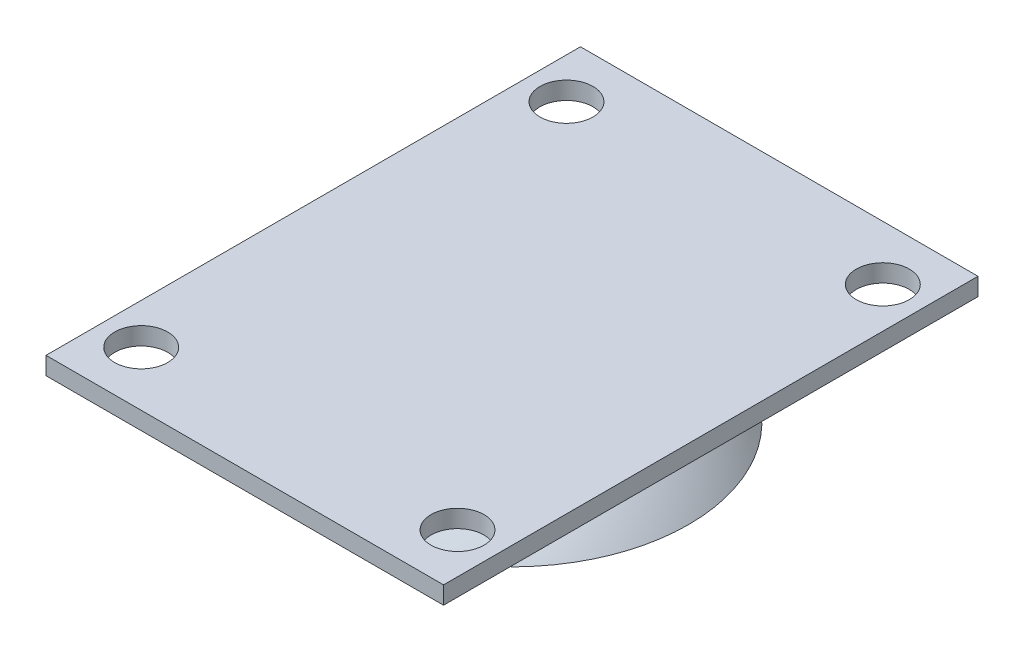
ISO-10303-21;
HEADER;
FILE_DESCRIPTION(('STEP AP214'),'2;1');
FILE_NAME('part.step','',(''),(''),'','','');
FILE_SCHEMA(('AUTOMOTIVE_DESIGN { 1 0 10303 214 1 1 1 1 }'));
ENDSEC;
DATA;
#1=APPLICATION_CONTEXT('core data for automotive mechanical design processes');
#2=APPLICATION_PROTOCOL_DEFINITION('international standard','automotive_design',2000,#1);
#3=PRODUCT_CONTEXT('',#1,'mechanical');
#4=PRODUCT('Part','Part','',(#3));
#5=PRODUCT_RELATED_PRODUCT_CATEGORY('part','',(#4));
#6=PRODUCT_DEFINITION_FORMATION('','',#4);
#7=PRODUCT_DEFINITION_CONTEXT('part definition',#1,'design');
#8=PRODUCT_DEFINITION('design','',#6,#7);
#9=PRODUCT_DEFINITION_SHAPE('','',#8);
#10=(LENGTH_UNIT() NAMED_UNIT(*) SI_UNIT(.MILLI.,.METRE.));
#11=(NAMED_UNIT(*) PLANE_ANGLE_UNIT() SI_UNIT($,.RADIAN.));
#12=(NAMED_UNIT(*) SI_UNIT($,.STERADIAN.) SOLID_ANGLE_UNIT());
#13=UNCERTAINTY_MEASURE_WITH_UNIT(LENGTH_MEASURE(1.E-05),#10,'distance_accuracy_value','');
#14=(GEOMETRIC_REPRESENTATION_CONTEXT(3) GLOBAL_UNCERTAINTY_ASSIGNED_CONTEXT((#13)) GLOBAL_UNIT_ASSIGNED_CONTEXT((#10,
#11,#12)) REPRESENTATION_CONTEXT('',''));
#15=CARTESIAN_POINT('',(0.,0.,0.));
#16=DIRECTION('',(0.,0.,1.));
#17=DIRECTION('',(1.,0.,0.));
#18=AXIS2_PLACEMENT_3D('',#15,#16,#17);
#19=CARTESIAN_POINT('',(0.,-2.01998092078022,0.));
#20=DIRECTION('',(0.,-1.,0.));
#21=DIRECTION('',(1.,0.,0.));
#22=AXIS2_PLACEMENT_3D('',#19,#20,#21);
#23=CONICAL_SURFACE('',#22,0.,1.54445985501859);
#24=CARTESIAN_POINT('',(0.,-2.07264777546617,0.));
#25=DIRECTION('',(0.,1.,0.));
#26=DIRECTION('',(-1.,0.,0.));
#27=AXIS2_PLACEMENT_3D('',#24,#25,#26);
#28=CIRCLE('',#27,1.99930643034466);
#29=CARTESIAN_POINT('',(-1.99930643034465,-2.07264777546617,0.));
#30=VERTEX_POINT('',#29);
#31=EDGE_CURVE('E12',#30,#30,#28,.T.);
#32=ORIENTED_EDGE('',*,*,#31,.F.);
#33=EDGE_LOOP('',(#32));
#34=FACE_BOUND('',#33,.T.);
#35=CARTESIAN_POINT('',(0.,-2.01998092078022,0.));
#36=VERTEX_POINT('',#35);
#37=VERTEX_LOOP('',#36);
#38=FACE_BOUND('',#37,.T.);
#39=ADVANCED_FACE('F44',(#34,#38),#23,.F.);
#40=CARTESIAN_POINT('',(1.99930643034296,-2.07264777546864,0.));
#41=CARTESIAN_POINT('',(2.66600766577475,-2.11729166220924,0.));
#42=CARTESIAN_POINT('',(4.01401916836039,-2.25161643467983,0.));
#43=CARTESIAN_POINT('',(6.54949998201587,-2.68338834364569,0.));
#44=CARTESIAN_POINT('',(9.52540791491086,-3.53379938436984,0.));
#45=CARTESIAN_POINT('',(12.7653946172974,-5.03564881742584,0.));
#46=CARTESIAN_POINT('',(14.7494498183649,-6.38036587132119,0.));
#47=CARTESIAN_POINT('',(15.6790017267229,-7.12439916746116,0.));
#48=B_SPLINE_CURVE_WITH_KNOTS('',3,(#40,#41,#42,#43,#44,#45,#46,#47),.UNSPECIFIED.,.F.,.F.,(4,1,
1,1,1,4),(0.0872314803986125,0.177417467087911,0.26760345377721,0.447975427155807,
0.628347400534404,0.808719373913002),.UNSPECIFIED.);
#49=CARTESIAN_POINT('',(0.,10.0059537659192,0.));
#50=DIRECTION('',(0.,1.,0.));
#51=AXIS1_PLACEMENT('',#49,#50);
#52=SURFACE_OF_REVOLUTION('',#48,#51);
#53=CARTESIAN_POINT('',(0.,-7.12439916746116,0.));
#54=DIRECTION('',(0.,1.,0.));
#55=DIRECTION('',(-1.,0.,0.));
#56=AXIS2_PLACEMENT_3D('',#53,#54,#55);
#57=CIRCLE('',#56,15.6790017267229);
#58=CARTESIAN_POINT('',(-15.6790017267229,-7.12439916746116,0.));
#59=VERTEX_POINT('',#58);
#60=EDGE_CURVE('E51',#59,#59,#57,.T.);
#61=ORIENTED_EDGE('',*,*,#60,.F.);
#62=EDGE_LOOP('',(#61));
#63=FACE_BOUND('',#62,.T.);
#64=ORIENTED_EDGE('',*,*,#31,.T.);
#65=EDGE_LOOP('',(#64));
#66=FACE_BOUND('',#65,.T.);
#67=ADVANCED_FACE('F71',(#63,#66),#52,.T.);
#68=CARTESIAN_POINT('',(0.,-7.12439916746116,0.));
#69=DIRECTION('',(0.,-1.,0.));
#70=DIRECTION('',(1.,0.,0.));
#71=AXIS2_PLACEMENT_3D('',#68,#69,#70);
#72=CONICAL_SURFACE('',#71,15.6790017267229,0.834112174074642);
#73=CARTESIAN_POINT('',(0.,-8.46807028808528,0.));
#74=DIRECTION('',(0.,1.,0.));
#75=DIRECTION('',(-1.,0.,0.));
#76=AXIS2_PLACEMENT_3D('',#73,#74,#75);
#77=CIRCLE('',#76,17.1604023881244);
#78=CARTESIAN_POINT('',(-17.1604023881244,-8.46807028808528,0.));
#79=VERTEX_POINT('',#78);
#80=EDGE_CURVE('E101',#79,#79,#77,.T.);
#81=ORIENTED_EDGE('',*,*,#80,.F.);
#82=EDGE_LOOP('',(#81));
#83=FACE_BOUND('',#82,.T.);
#84=ORIENTED_EDGE('',*,*,#60,.T.);
#85=EDGE_LOOP('',(#84));
#86=FACE_BOUND('',#85,.T.);
#87=ADVANCED_FACE('F65',(#83,#86),#72,.F.);
#88=CARTESIAN_POINT('',(0.,-8.46807028808527,0.));
#89=DIRECTION('',(0.,-1.,0.));
#90=DIRECTION('',(1.,0.,0.));
#91=AXIS2_PLACEMENT_3D('',#88,#89,#90);
#92=PLANE('',#91);
#93=ORIENTED_EDGE('',*,*,#80,.T.);
#94=EDGE_LOOP('',(#93));
#95=FACE_BOUND('',#94,.T.);
#96=CARTESIAN_POINT('',(0.,-8.46807028808528,0.));
#97=DIRECTION('',(0.,1.,0.));
#98=DIRECTION('',(-1.,0.,0.));
#99=AXIS2_PLACEMENT_3D('',#96,#97,#98);
#100=CIRCLE('',#99,20.);
#101=CARTESIAN_POINT('',(-20.,-8.46807028808528,0.));
#102=VERTEX_POINT('',#101);
#103=EDGE_CURVE('E96',#102,#102,#100,.T.);
#104=ORIENTED_EDGE('',*,*,#103,.F.);
#105=EDGE_LOOP('',(#104));
#106=FACE_BOUND('',#105,.T.);
#107=ADVANCED_FACE('F59',(#95,#106),#92,.T.);
#108=CARTESIAN_POINT('',(0.,0.,0.));
#109=CARTESIAN_POINT('',(12.4384062197787,-0.0796283350425367,0.));
#110=CARTESIAN_POINT('',(20.,-8.46807028808527,0.));
#111=B_SPLINE_CURVE_WITH_KNOTS('',2,(#108,#109,#110),.UNSPECIFIED.,.F.,.F.,(3,3),(0.,1.),.UNSPECIFIED.);
#112=CARTESIAN_POINT('',(0.,10.0059537659192,0.));
#113=DIRECTION('',(0.,1.,0.));
#114=AXIS1_PLACEMENT('',#112,#113);
#115=SURFACE_OF_REVOLUTION('',#111,#114);
#116=ORIENTED_EDGE('',*,*,#103,.T.);
#117=EDGE_LOOP('',(#116));
#118=FACE_BOUND('',#117,.T.);
#119=CARTESIAN_POINT('',(0.,0.,0.));
#120=VERTEX_POINT('',#119);
#121=VERTEX_LOOP('',#120);
#122=FACE_BOUND('',#121,.T.);
#123=ADVANCED_FACE('F57',(#118,#122),#115,.F.);
#124=CLOSED_SHELL('',(#39,#67,#87,#107,#123));
#125=MANIFOLD_SOLID_BREP('B2',#124);
#126=CARTESIAN_POINT('',(0.,2.,0.));
#127=DIRECTION('',(0.,1.,0.));
#128=DIRECTION('',(0.,0.,1.));
#129=AXIS2_PLACEMENT_3D('',#126,#127,#128);
#130=PLANE('',#129);
#131=CARTESIAN_POINT('',(17.904367565143,2.,24.0714275042478));
#132=DIRECTION('',(0.,1.,0.));
#133=DIRECTION('',(0.,0.,-1.));
#134=AXIS2_PLACEMENT_3D('',#131,#132,#133);
#135=CIRCLE('',#134,3.);
#136=CARTESIAN_POINT('',(17.904367565143,2.,21.0714275042478));
#137=VERTEX_POINT('',#136);
#138=EDGE_CURVE('E222',#137,#137,#135,.T.);
#139=ORIENTED_EDGE('',*,*,#138,.F.);
#140=EDGE_LOOP('',(#139));
#141=FACE_BOUND('',#140,.T.);
#142=CARTESIAN_POINT('',(17.904367565143,2.,-24.0714275042478));
#143=DIRECTION('',(0.,1.,0.));
#144=DIRECTION('',(0.,0.,1.));
#145=AXIS2_PLACEMENT_3D('',#142,#143,#144);
#146=CIRCLE('',#145,3.);
#147=CARTESIAN_POINT('',(17.904367565143,2.,-21.0714275042478));
#148=VERTEX_POINT('',#147);
#149=EDGE_CURVE('E201',#148,#148,#146,.T.);
#150=ORIENTED_EDGE('',*,*,#149,.F.);
#151=EDGE_LOOP('',(#150));
#152=FACE_BOUND('',#151,.T.);
#153=DIRECTION('',(0.,0.,-1.));
#154=VECTOR('',#153,1.);
#155=CARTESIAN_POINT('',(22.5,2.,-30.25));
#156=LINE('',#155,#154);
#157=CARTESIAN_POINT('',(22.5,2.,30.25));
#158=VERTEX_POINT('',#157);
#159=CARTESIAN_POINT('',(22.5,2.,-30.25));
#160=VERTEX_POINT('',#159);
#161=EDGE_CURVE('E186',#158,#160,#156,.T.);
#162=ORIENTED_EDGE('',*,*,#161,.T.);
#163=DIRECTION('',(-1.,0.,0.));
#164=VECTOR('',#163,1.);
#165=CARTESIAN_POINT('',(-22.5,2.,-30.25));
#166=LINE('',#165,#164);
#167=CARTESIAN_POINT('',(-22.5,2.,-30.25));
#168=VERTEX_POINT('',#167);
#169=EDGE_CURVE('E181',#160,#168,#166,.T.);
#170=ORIENTED_EDGE('',*,*,#169,.T.);
#171=DIRECTION('',(0.,0.,1.));
#172=VECTOR('',#171,1.);
#173=CARTESIAN_POINT('',(-22.5,2.,-30.25));
#174=LINE('',#173,#172);
#175=CARTESIAN_POINT('',(-22.5,2.,30.25));
#176=VERTEX_POINT('',#175);
#177=EDGE_CURVE('E184',#168,#176,#174,.T.);
#178=ORIENTED_EDGE('',*,*,#177,.T.);
#179=DIRECTION('',(1.,0.,0.));
#180=VECTOR('',#179,1.);
#181=CARTESIAN_POINT('',(-22.5,2.,30.25));
#182=LINE('',#181,#180);
#183=EDGE_CURVE('E151',#176,#158,#182,.T.);
#184=ORIENTED_EDGE('',*,*,#183,.T.);
#185=EDGE_LOOP('',(#162,#170,#178,#184));
#186=FACE_BOUND('',#185,.T.);
#187=CARTESIAN_POINT('',(-17.904367565143,2.,-24.0714275042478));
#188=DIRECTION('',(0.,1.,0.));
#189=DIRECTION('',(0.,0.,-1.));
#190=AXIS2_PLACEMENT_3D('',#187,#188,#189);
#191=CIRCLE('',#190,3.);
#192=CARTESIAN_POINT('',(-17.904367565143,2.,-27.0714275042478));
#193=VERTEX_POINT('',#192);
#194=EDGE_CURVE('E216',#193,#193,#191,.T.);
#195=ORIENTED_EDGE('',*,*,#194,.F.);
#196=EDGE_LOOP('',(#195));
#197=FACE_BOUND('',#196,.T.);
#198=CARTESIAN_POINT('',(-17.904367565143,2.,24.0714275042478));
#199=DIRECTION('',(0.,1.,0.));
#200=DIRECTION('',(0.,0.,1.));
#201=AXIS2_PLACEMENT_3D('',#198,#199,#200);
#202=CIRCLE('',#201,3.);
#203=CARTESIAN_POINT('',(-17.904367565143,2.,27.0714275042478));
#204=VERTEX_POINT('',#203);
#205=EDGE_CURVE('E228',#204,#204,#202,.T.);
#206=ORIENTED_EDGE('',*,*,#205,.F.);
#207=EDGE_LOOP('',(#206));
#208=FACE_BOUND('',#207,.T.);
#209=ADVANCED_FACE('F134',(#141,#152,#186,#197,#208),#130,.T.);
#210=CARTESIAN_POINT('',(0.,0.,0.));
#211=DIRECTION('',(0.,1.,0.));
#212=DIRECTION('',(0.,0.,1.));
#213=AXIS2_PLACEMENT_3D('',#210,#211,#212);
#214=PLANE('',#213);
#215=DIRECTION('',(0.,0.,-1.));
#216=VECTOR('',#215,1.);
#217=CARTESIAN_POINT('',(22.5,0.,-30.25));
#218=LINE('',#217,#216);
#219=CARTESIAN_POINT('',(22.5,0.,30.25));
#220=VERTEX_POINT('',#219);
#221=CARTESIAN_POINT('',(22.5,0.,-30.25));
#222=VERTEX_POINT('',#221);
#223=EDGE_CURVE('E198',#220,#222,#218,.T.);
#224=ORIENTED_EDGE('',*,*,#223,.F.);
#225=DIRECTION('',(1.,0.,0.));
#226=VECTOR('',#225,1.);
#227=CARTESIAN_POINT('',(-22.5,0.,30.25));
#228=LINE('',#227,#226);
#229=CARTESIAN_POINT('',(-22.5,0.,30.25));
#230=VERTEX_POINT('',#229);
#231=EDGE_CURVE('E174',#230,#220,#228,.T.);
#232=ORIENTED_EDGE('',*,*,#231,.F.);
#233=DIRECTION('',(0.,0.,1.));
#234=VECTOR('',#233,1.);
#235=CARTESIAN_POINT('',(-22.5,0.,-30.25));
#236=LINE('',#235,#234);
#237=CARTESIAN_POINT('',(-22.5,0.,-30.25));
#238=VERTEX_POINT('',#237);
#239=EDGE_CURVE('E168',#238,#230,#236,.T.);
#240=ORIENTED_EDGE('',*,*,#239,.F.);
#241=DIRECTION('',(-1.,0.,0.));
#242=VECTOR('',#241,1.);
#243=CARTESIAN_POINT('',(-22.5,0.,-30.25));
#244=LINE('',#243,#242);
#245=EDGE_CURVE('E190',#222,#238,#244,.T.);
#246=ORIENTED_EDGE('',*,*,#245,.F.);
#247=EDGE_LOOP('',(#224,#232,#240,#246));
#248=FACE_BOUND('',#247,.T.);
#249=CARTESIAN_POINT('',(17.904367565143,0.,-24.0714275042478));
#250=DIRECTION('',(0.,1.,0.));
#251=DIRECTION('',(0.,0.,1.));
#252=AXIS2_PLACEMENT_3D('',#249,#250,#251);
#253=CIRCLE('',#252,3.);
#254=CARTESIAN_POINT('',(17.904367565143,0.,-21.0714275042478));
#255=VERTEX_POINT('',#254);
#256=EDGE_CURVE('E213',#255,#255,#253,.T.);
#257=ORIENTED_EDGE('',*,*,#256,.T.);
#258=EDGE_LOOP('',(#257));
#259=FACE_BOUND('',#258,.T.);
#260=CARTESIAN_POINT('',(-17.904367565143,0.,-24.0714275042478));
#261=DIRECTION('',(0.,1.,0.));
#262=DIRECTION('',(0.,0.,-1.));
#263=AXIS2_PLACEMENT_3D('',#260,#261,#262);
#264=CIRCLE('',#263,3.);
#265=CARTESIAN_POINT('',(-17.904367565143,0.,-27.0714275042478));
#266=VERTEX_POINT('',#265);
#267=EDGE_CURVE('E219',#266,#266,#264,.T.);
#268=ORIENTED_EDGE('',*,*,#267,.T.);
#269=EDGE_LOOP('',(#268));
#270=FACE_BOUND('',#269,.T.);
#271=CARTESIAN_POINT('',(17.904367565143,0.,24.0714275042478));
#272=DIRECTION('',(0.,1.,0.));
#273=DIRECTION('',(0.,0.,-1.));
#274=AXIS2_PLACEMENT_3D('',#271,#272,#273);
#275=CIRCLE('',#274,3.);
#276=CARTESIAN_POINT('',(17.904367565143,0.,21.0714275042478));
#277=VERTEX_POINT('',#276);
#278=EDGE_CURVE('E225',#277,#277,#275,.T.);
#279=ORIENTED_EDGE('',*,*,#278,.T.);
#280=EDGE_LOOP('',(#279));
#281=FACE_BOUND('',#280,.T.);
#282=CARTESIAN_POINT('',(-17.904367565143,0.,24.0714275042478));
#283=DIRECTION('',(0.,1.,0.));
#284=DIRECTION('',(0.,0.,1.));
#285=AXIS2_PLACEMENT_3D('',#282,#283,#284);
#286=CIRCLE('',#285,3.);
#287=CARTESIAN_POINT('',(-17.904367565143,0.,27.0714275042478));
#288=VERTEX_POINT('',#287);
#289=EDGE_CURVE('E231',#288,#288,#286,.T.);
#290=ORIENTED_EDGE('',*,*,#289,.T.);
#291=EDGE_LOOP('',(#290));
#292=FACE_BOUND('',#291,.T.);
#293=ADVANCED_FACE('F209',(#248,#259,#270,#281,#292),#214,.F.);
#294=CARTESIAN_POINT('',(22.5,2.,-30.25));
#295=DIRECTION('',(-1.,0.,0.));
#296=DIRECTION('',(0.,0.,1.));
#297=AXIS2_PLACEMENT_3D('',#294,#295,#296);
#298=PLANE('',#297);
#299=ORIENTED_EDGE('',*,*,#223,.T.);
#300=DIRECTION('',(0.,-1.,0.));
#301=VECTOR('',#300,1.);
#302=CARTESIAN_POINT('',(22.5,2.,-30.25));
#303=LINE('',#302,#301);
#304=EDGE_CURVE('E42',#160,#222,#303,.T.);
#305=ORIENTED_EDGE('',*,*,#304,.F.);
#306=ORIENTED_EDGE('',*,*,#161,.F.);
#307=DIRECTION('',(0.,-1.,0.));
#308=VECTOR('',#307,1.);
#309=CARTESIAN_POINT('',(22.5,2.,30.25));
#310=LINE('',#309,#308);
#311=EDGE_CURVE('E194',#158,#220,#310,.T.);
#312=ORIENTED_EDGE('',*,*,#311,.T.);
#313=EDGE_LOOP('',(#299,#305,#306,#312));
#314=FACE_BOUND('',#313,.T.);
#315=ADVANCED_FACE('F136',(#314),#298,.F.);
#316=CARTESIAN_POINT('',(-22.5,2.,-30.25));
#317=DIRECTION('',(0.,0.,1.));
#318=DIRECTION('',(1.,0.,0.));
#319=AXIS2_PLACEMENT_3D('',#316,#317,#318);
#320=PLANE('',#319);
#321=ORIENTED_EDGE('',*,*,#245,.T.);
#322=DIRECTION('',(0.,-1.,0.));
#323=VECTOR('',#322,1.);
#324=CARTESIAN_POINT('',(-22.5,2.,-30.25));
#325=LINE('',#324,#323);
#326=EDGE_CURVE('E143',#168,#238,#325,.T.);
#327=ORIENTED_EDGE('',*,*,#326,.F.);
#328=ORIENTED_EDGE('',*,*,#169,.F.);
#329=ORIENTED_EDGE('',*,*,#304,.T.);
#330=EDGE_LOOP('',(#321,#327,#328,#329));
#331=FACE_BOUND('',#330,.T.);
#332=ADVANCED_FACE('F189',(#331),#320,.F.);
#333=CARTESIAN_POINT('',(-22.5,2.,-30.25));
#334=DIRECTION('',(1.,0.,0.));
#335=DIRECTION('',(0.,0.,-1.));
#336=AXIS2_PLACEMENT_3D('',#333,#334,#335);
#337=PLANE('',#336);
#338=ORIENTED_EDGE('',*,*,#239,.T.);
#339=DIRECTION('',(0.,-1.,0.));
#340=VECTOR('',#339,1.);
#341=CARTESIAN_POINT('',(-22.5,2.,30.25));
#342=LINE('',#341,#340);
#343=EDGE_CURVE('E191',#176,#230,#342,.T.);
#344=ORIENTED_EDGE('',*,*,#343,.F.);
#345=ORIENTED_EDGE('',*,*,#177,.F.);
#346=ORIENTED_EDGE('',*,*,#326,.T.);
#347=EDGE_LOOP('',(#338,#344,#345,#346));
#348=FACE_BOUND('',#347,.T.);
#349=ADVANCED_FACE('F192',(#348),#337,.F.);
#350=CARTESIAN_POINT('',(-22.5,2.,30.25));
#351=DIRECTION('',(0.,0.,-1.));
#352=DIRECTION('',(-1.,0.,0.));
#353=AXIS2_PLACEMENT_3D('',#350,#351,#352);
#354=PLANE('',#353);
#355=ORIENTED_EDGE('',*,*,#231,.T.);
#356=ORIENTED_EDGE('',*,*,#311,.F.);
#357=ORIENTED_EDGE('',*,*,#183,.F.);
#358=ORIENTED_EDGE('',*,*,#343,.T.);
#359=EDGE_LOOP('',(#355,#356,#357,#358));
#360=FACE_BOUND('',#359,.T.);
#361=ADVANCED_FACE('F206',(#360),#354,.F.);
#362=CARTESIAN_POINT('',(17.904367565143,2.,-24.0714275042478));
#363=DIRECTION('',(0.,-1.,0.));
#364=DIRECTION('',(0.,0.,-1.));
#365=AXIS2_PLACEMENT_3D('',#362,#363,#364);
#366=CYLINDRICAL_SURFACE('',#365,3.);
#367=ORIENTED_EDGE('',*,*,#149,.T.);
#368=EDGE_LOOP('',(#367));
#369=FACE_BOUND('',#368,.T.);
#370=ORIENTED_EDGE('',*,*,#256,.F.);
#371=EDGE_LOOP('',(#370));
#372=FACE_BOUND('',#371,.T.);
#373=ADVANCED_FACE('F250',(#369,#372),#366,.F.);
#374=CARTESIAN_POINT('',(-17.904367565143,2.,-24.0714275042478));
#375=DIRECTION('',(0.,-1.,0.));
#376=DIRECTION('',(0.,0.,-1.));
#377=AXIS2_PLACEMENT_3D('',#374,#375,#376);
#378=CYLINDRICAL_SURFACE('',#377,3.);
#379=ORIENTED_EDGE('',*,*,#194,.T.);
#380=EDGE_LOOP('',(#379));
#381=FACE_BOUND('',#380,.T.);
#382=ORIENTED_EDGE('',*,*,#267,.F.);
#383=EDGE_LOOP('',(#382));
#384=FACE_BOUND('',#383,.T.);
#385=ADVANCED_FACE('F296',(#381,#384),#378,.F.);
#386=CARTESIAN_POINT('',(17.904367565143,2.,24.0714275042478));
#387=DIRECTION('',(0.,-1.,0.));
#388=DIRECTION('',(0.,0.,-1.));
#389=AXIS2_PLACEMENT_3D('',#386,#387,#388);
#390=CYLINDRICAL_SURFACE('',#389,3.);
#391=ORIENTED_EDGE('',*,*,#138,.T.);
#392=EDGE_LOOP('',(#391));
#393=FACE_BOUND('',#392,.T.);
#394=ORIENTED_EDGE('',*,*,#278,.F.);
#395=EDGE_LOOP('',(#394));
#396=FACE_BOUND('',#395,.T.);
#397=ADVANCED_FACE('F304',(#393,#396),#390,.F.);
#398=CARTESIAN_POINT('',(-17.904367565143,2.,24.0714275042478));
#399=DIRECTION('',(0.,-1.,0.));
#400=DIRECTION('',(0.,0.,-1.));
#401=AXIS2_PLACEMENT_3D('',#398,#399,#400);
#402=CYLINDRICAL_SURFACE('',#401,3.);
#403=ORIENTED_EDGE('',*,*,#205,.T.);
#404=EDGE_LOOP('',(#403));
#405=FACE_BOUND('',#404,.T.);
#406=ORIENTED_EDGE('',*,*,#289,.F.);
#407=EDGE_LOOP('',(#406));
#408=FACE_BOUND('',#407,.T.);
#409=ADVANCED_FACE('F237',(#405,#408),#402,.F.);
#410=CLOSED_SHELL('',(#209,#293,#315,#332,#349,#361,#373,#385,#397,#409));
#411=MANIFOLD_SOLID_BREP('B6',#410);
#412=ADVANCED_BREP_SHAPE_REPRESENTATION('',(#18,#125,#411),#14);
#413=SHAPE_DEFINITION_REPRESENTATION(#9,#412);
ENDSEC;
END-ISO-10303-21;
